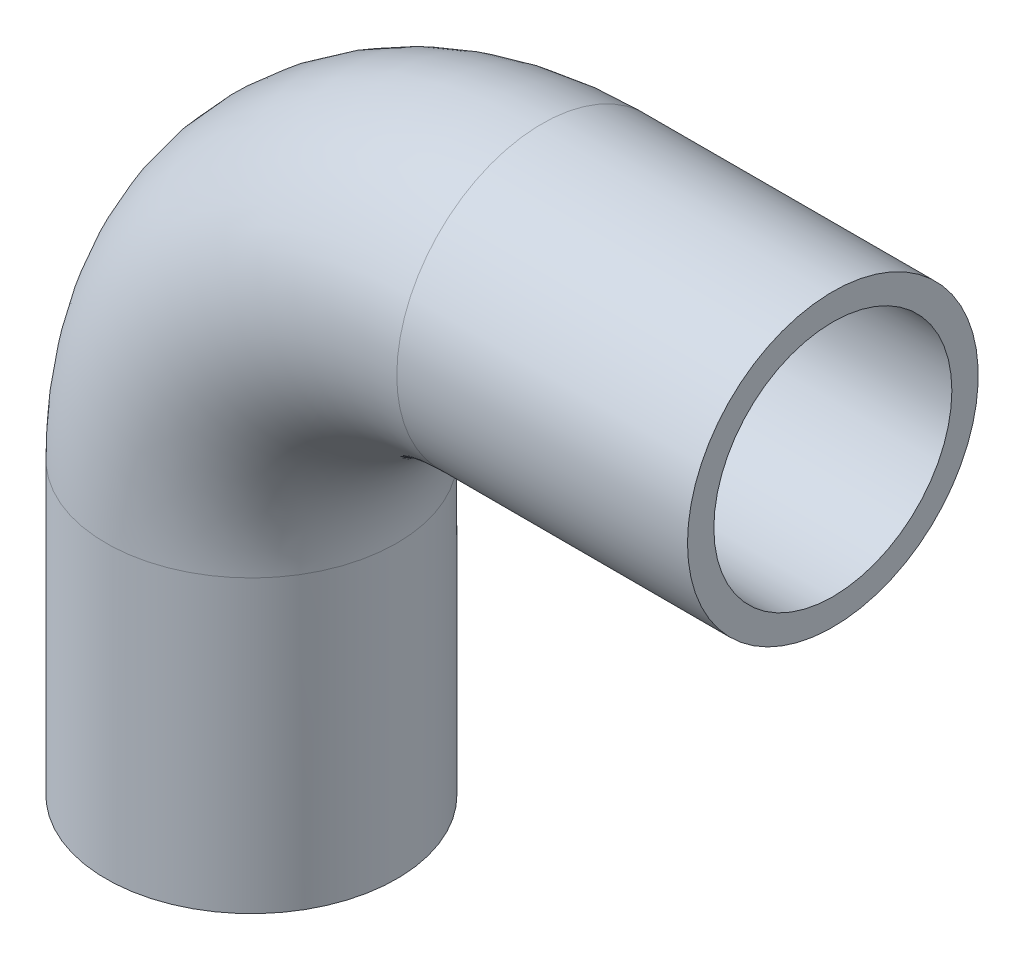
ISO-10303-21;
HEADER;
FILE_DESCRIPTION(('STEP AP214'),'2;1');
FILE_NAME('part.step','',(''),(''),'','','');
FILE_SCHEMA(('AUTOMOTIVE_DESIGN { 1 0 10303 214 1 1 1 1 }'));
ENDSEC;
DATA;
#1=APPLICATION_CONTEXT('core data for automotive mechanical design processes');
#2=APPLICATION_PROTOCOL_DEFINITION('international standard','automotive_design',2000,#1);
#3=PRODUCT_CONTEXT('',#1,'mechanical');
#4=PRODUCT('Part','Part','',(#3));
#5=PRODUCT_RELATED_PRODUCT_CATEGORY('part','',(#4));
#6=PRODUCT_DEFINITION_FORMATION('','',#4);
#7=PRODUCT_DEFINITION_CONTEXT('part definition',#1,'design');
#8=PRODUCT_DEFINITION('design','',#6,#7);
#9=PRODUCT_DEFINITION_SHAPE('','',#8);
#10=(LENGTH_UNIT() NAMED_UNIT(*) SI_UNIT(.MILLI.,.METRE.));
#11=(NAMED_UNIT(*) PLANE_ANGLE_UNIT() SI_UNIT($,.RADIAN.));
#12=(NAMED_UNIT(*) SI_UNIT($,.STERADIAN.) SOLID_ANGLE_UNIT());
#13=UNCERTAINTY_MEASURE_WITH_UNIT(LENGTH_MEASURE(1.E-05),#10,'distance_accuracy_value','');
#14=(GEOMETRIC_REPRESENTATION_CONTEXT(3) GLOBAL_UNCERTAINTY_ASSIGNED_CONTEXT((#13)) GLOBAL_UNIT_ASSIGNED_CONTEXT((#10,
#11,#12)) REPRESENTATION_CONTEXT('',''));
#15=CARTESIAN_POINT('',(0.,0.,0.));
#16=DIRECTION('',(0.,0.,1.));
#17=DIRECTION('',(1.,0.,0.));
#18=AXIS2_PLACEMENT_3D('',#15,#16,#17);
#19=CARTESIAN_POINT('',(75.,75.,0.));
#20=DIRECTION('',(0.,0.,1.));
#21=DIRECTION('',(1.,0.,0.));
#22=AXIS2_PLACEMENT_3D('',#19,#20,#21);
#23=TOROIDAL_SURFACE('',#22,75.,30.7);
#24=CARTESIAN_POINT('',(75.,150.,0.));
#25=DIRECTION('',(-1.,0.,0.));
#26=DIRECTION('',(0.,1.,0.));
#27=AXIS2_PLACEMENT_3D('',#24,#25,#26);
#28=CIRCLE('',#27,30.7);
#29=CARTESIAN_POINT('',(75.,180.7,0.));
#30=VERTEX_POINT('',#29);
#31=EDGE_CURVE('E33',#30,#30,#28,.T.);
#32=ORIENTED_EDGE('',*,*,#31,.F.);
#33=EDGE_LOOP('',(#32));
#34=FACE_BOUND('',#33,.T.);
#35=CARTESIAN_POINT('',(0.,75.,0.));
#36=DIRECTION('',(0.,-1.,0.));
#37=DIRECTION('',(-1.,0.,0.));
#38=AXIS2_PLACEMENT_3D('',#35,#36,#37);
#39=CIRCLE('',#38,30.7);
#40=CARTESIAN_POINT('',(-30.7,75.,0.));
#41=VERTEX_POINT('',#40);
#42=EDGE_CURVE('E31',#41,#41,#39,.F.);
#43=ORIENTED_EDGE('',*,*,#42,.F.);
#44=EDGE_LOOP('',(#43));
#45=FACE_BOUND('',#44,.T.);
#46=ADVANCED_FACE('F13',(#34,#45),#23,.F.);
#47=CARTESIAN_POINT('',(150.,150.,0.));
#48=DIRECTION('',(-1.,0.,0.));
#49=DIRECTION('',(0.,0.,1.));
#50=AXIS2_PLACEMENT_3D('',#47,#48,#49);
#51=CYLINDRICAL_SURFACE('',#50,30.7);
#52=CARTESIAN_POINT('',(150.,150.,0.));
#53=DIRECTION('',(-1.,0.,0.));
#54=DIRECTION('',(0.,0.,1.));
#55=AXIS2_PLACEMENT_3D('',#52,#53,#54);
#56=CIRCLE('',#55,30.7);
#57=CARTESIAN_POINT('',(150.,150.,30.7));
#58=VERTEX_POINT('',#57);
#59=EDGE_CURVE('E17',#58,#58,#56,.T.);
#60=ORIENTED_EDGE('',*,*,#59,.F.);
#61=EDGE_LOOP('',(#60));
#62=FACE_BOUND('',#61,.T.);
#63=ORIENTED_EDGE('',*,*,#31,.T.);
#64=EDGE_LOOP('',(#63));
#65=FACE_BOUND('',#64,.T.);
#66=ADVANCED_FACE('F52',(#62,#65),#51,.F.);
#67=CARTESIAN_POINT('',(0.,75.,0.));
#68=DIRECTION('',(0.,-1.,0.));
#69=DIRECTION('',(0.,0.,-1.));
#70=AXIS2_PLACEMENT_3D('',#67,#68,#69);
#71=CYLINDRICAL_SURFACE('',#70,30.7);
#72=ORIENTED_EDGE('',*,*,#42,.T.);
#73=EDGE_LOOP('',(#72));
#74=FACE_BOUND('',#73,.T.);
#75=CARTESIAN_POINT('',(0.,0.,0.));
#76=DIRECTION('',(0.,-1.,0.));
#77=DIRECTION('',(0.,0.,-1.));
#78=AXIS2_PLACEMENT_3D('',#75,#76,#77);
#79=CIRCLE('',#78,30.7);
#80=CARTESIAN_POINT('',(0.,0.,-30.7));
#81=VERTEX_POINT('',#80);
#82=EDGE_CURVE('E42',#81,#81,#79,.F.);
#83=ORIENTED_EDGE('',*,*,#82,.F.);
#84=EDGE_LOOP('',(#83));
#85=FACE_BOUND('',#84,.T.);
#86=ADVANCED_FACE('F55',(#74,#85),#71,.F.);
#87=CARTESIAN_POINT('',(150.,187.5,37.9500021082955));
#88=DIRECTION('',(1.,0.,0.));
#89=DIRECTION('',(0.,-1.,0.));
#90=AXIS2_PLACEMENT_3D('',#87,#88,#89);
#91=PLANE('',#90);
#92=ORIENTED_EDGE('',*,*,#59,.T.);
#93=EDGE_LOOP('',(#92));
#94=FACE_BOUND('',#93,.T.);
#95=CARTESIAN_POINT('',(150.,150.,0.));
#96=DIRECTION('',(-1.,0.,0.));
#97=DIRECTION('',(0.,0.,1.));
#98=AXIS2_PLACEMENT_3D('',#95,#96,#97);
#99=CIRCLE('',#98,37.5);
#100=CARTESIAN_POINT('',(150.,150.,37.5));
#101=VERTEX_POINT('',#100);
#102=EDGE_CURVE('E40',#101,#101,#99,.T.);
#103=ORIENTED_EDGE('',*,*,#102,.F.);
#104=EDGE_LOOP('',(#103));
#105=FACE_BOUND('',#104,.T.);
#106=ADVANCED_FACE('F49',(#94,#105),#91,.T.);
#107=CARTESIAN_POINT('',(37.5,0.,37.9500021082962));
#108=DIRECTION('',(0.,-1.,0.));
#109=DIRECTION('',(-1.,0.,0.));
#110=AXIS2_PLACEMENT_3D('',#107,#108,#109);
#111=PLANE('',#110);
#112=ORIENTED_EDGE('',*,*,#82,.T.);
#113=EDGE_LOOP('',(#112));
#114=FACE_BOUND('',#113,.T.);
#115=CARTESIAN_POINT('',(0.,0.,0.));
#116=DIRECTION('',(0.,-1.,0.));
#117=DIRECTION('',(0.,0.,-1.));
#118=AXIS2_PLACEMENT_3D('',#115,#116,#117);
#119=CIRCLE('',#118,37.5);
#120=CARTESIAN_POINT('',(0.,0.,-37.5));
#121=VERTEX_POINT('',#120);
#122=EDGE_CURVE('E26',#121,#121,#119,.F.);
#123=ORIENTED_EDGE('',*,*,#122,.F.);
#124=EDGE_LOOP('',(#123));
#125=FACE_BOUND('',#124,.T.);
#126=ADVANCED_FACE('F69',(#114,#125),#111,.T.);
#127=CARTESIAN_POINT('',(75.,150.,0.));
#128=DIRECTION('',(-1.,0.,0.));
#129=DIRECTION('',(0.,0.,1.));
#130=AXIS2_PLACEMENT_3D('',#127,#128,#129);
#131=CYLINDRICAL_SURFACE('',#130,37.5);
#132=ORIENTED_EDGE('',*,*,#102,.T.);
#133=EDGE_LOOP('',(#132));
#134=FACE_BOUND('',#133,.T.);
#135=CARTESIAN_POINT('',(75.,150.,0.));
#136=DIRECTION('',(-1.,0.,0.));
#137=DIRECTION('',(0.,-1.,0.));
#138=AXIS2_PLACEMENT_3D('',#135,#136,#137);
#139=CIRCLE('',#138,37.5);
#140=CARTESIAN_POINT('',(75.,112.5,0.));
#141=VERTEX_POINT('',#140);
#142=EDGE_CURVE('E21',#141,#141,#139,.T.);
#143=ORIENTED_EDGE('',*,*,#142,.F.);
#144=EDGE_LOOP('',(#143));
#145=FACE_BOUND('',#144,.T.);
#146=ADVANCED_FACE('F79',(#134,#145),#131,.T.);
#147=CARTESIAN_POINT('',(0.,0.,0.));
#148=DIRECTION('',(0.,-1.,0.));
#149=DIRECTION('',(0.,0.,-1.));
#150=AXIS2_PLACEMENT_3D('',#147,#148,#149);
#151=CYLINDRICAL_SURFACE('',#150,37.5);
#152=CARTESIAN_POINT('',(0.,75.,0.));
#153=DIRECTION('',(0.,-1.,0.));
#154=DIRECTION('',(1.,0.,0.));
#155=AXIS2_PLACEMENT_3D('',#152,#153,#154);
#156=CIRCLE('',#155,37.5);
#157=CARTESIAN_POINT('',(37.5,75.,0.));
#158=VERTEX_POINT('',#157);
#159=EDGE_CURVE('E8',#158,#158,#156,.F.);
#160=ORIENTED_EDGE('',*,*,#159,.F.);
#161=EDGE_LOOP('',(#160));
#162=FACE_BOUND('',#161,.T.);
#163=ORIENTED_EDGE('',*,*,#122,.T.);
#164=EDGE_LOOP('',(#163));
#165=FACE_BOUND('',#164,.T.);
#166=ADVANCED_FACE('F73',(#162,#165),#151,.T.);
#167=CARTESIAN_POINT('',(75.,75.,0.));
#168=DIRECTION('',(0.,0.,1.));
#169=DIRECTION('',(1.,0.,0.));
#170=AXIS2_PLACEMENT_3D('',#167,#168,#169);
#171=TOROIDAL_SURFACE('',#170,75.,37.5);
#172=ORIENTED_EDGE('',*,*,#142,.T.);
#173=EDGE_LOOP('',(#172));
#174=FACE_BOUND('',#173,.T.);
#175=ORIENTED_EDGE('',*,*,#159,.T.);
#176=EDGE_LOOP('',(#175));
#177=FACE_BOUND('',#176,.T.);
#178=ADVANCED_FACE('F71',(#174,#177),#171,.T.);
#179=CLOSED_SHELL('',(#46,#66,#86,#106,#126,#146,#166,#178));
#180=MANIFOLD_SOLID_BREP('B1',#179);
#181=ADVANCED_BREP_SHAPE_REPRESENTATION('',(#18,#180),#14);
#182=SHAPE_DEFINITION_REPRESENTATION(#9,#181);
ENDSEC;
END-ISO-10303-21;
